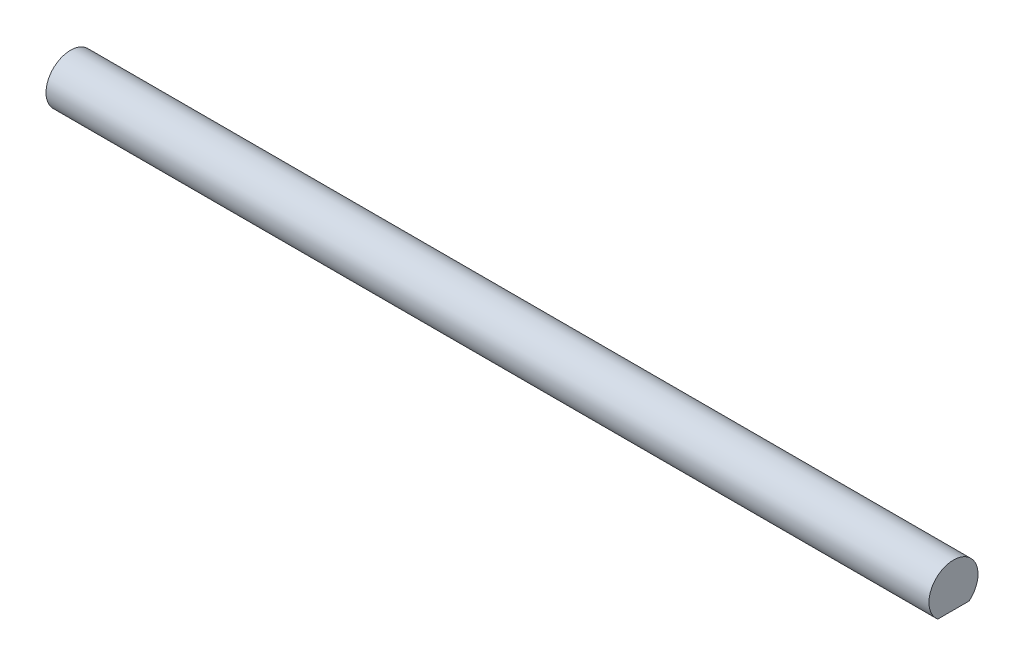
ISO-10303-21;
HEADER;
FILE_DESCRIPTION(('STEP AP214'),'2;1');
FILE_NAME('part.step','',(''),(''),'','','');
FILE_SCHEMA(('AUTOMOTIVE_DESIGN { 1 0 10303 214 1 1 1 1 }'));
ENDSEC;
DATA;
#1=APPLICATION_CONTEXT('core data for automotive mechanical design processes');
#2=APPLICATION_PROTOCOL_DEFINITION('international standard','automotive_design',2000,#1);
#3=PRODUCT_CONTEXT('',#1,'mechanical');
#4=PRODUCT('Part','Part','',(#3));
#5=PRODUCT_RELATED_PRODUCT_CATEGORY('part','',(#4));
#6=PRODUCT_DEFINITION_FORMATION('','',#4);
#7=PRODUCT_DEFINITION_CONTEXT('part definition',#1,'design');
#8=PRODUCT_DEFINITION('design','',#6,#7);
#9=PRODUCT_DEFINITION_SHAPE('','',#8);
#10=(LENGTH_UNIT() NAMED_UNIT(*) SI_UNIT(.MILLI.,.METRE.));
#11=(NAMED_UNIT(*) PLANE_ANGLE_UNIT() SI_UNIT($,.RADIAN.));
#12=(NAMED_UNIT(*) SI_UNIT($,.STERADIAN.) SOLID_ANGLE_UNIT());
#13=UNCERTAINTY_MEASURE_WITH_UNIT(LENGTH_MEASURE(1.E-05),#10,'distance_accuracy_value','');
#14=(GEOMETRIC_REPRESENTATION_CONTEXT(3) GLOBAL_UNCERTAINTY_ASSIGNED_CONTEXT((#13)) GLOBAL_UNIT_ASSIGNED_CONTEXT((#10,
#11,#12)) REPRESENTATION_CONTEXT('',''));
#15=CARTESIAN_POINT('',(0.,0.,0.));
#16=DIRECTION('',(0.,0.,1.));
#17=DIRECTION('',(1.,0.,0.));
#18=AXIS2_PLACEMENT_3D('',#15,#16,#17);
#19=CARTESIAN_POINT('',(304.8,-2.43959033446192,0.));
#20=DIRECTION('',(0.,1.,0.));
#21=DIRECTION('',(0.,0.,1.));
#22=AXIS2_PLACEMENT_3D('',#19,#20,#21);
#23=PLANE('',#22);
#24=DIRECTION('',(0.,0.,-1.));
#25=VECTOR('',#24,1.);
#26=CARTESIAN_POINT('',(114.3,-2.43959033446192,0.));
#27=LINE('',#26,#25);
#28=CARTESIAN_POINT('',(114.3,-2.43959033446192,2.032));
#29=VERTEX_POINT('',#28);
#30=CARTESIAN_POINT('',(114.3,-2.43959033446192,-2.032));
#31=VERTEX_POINT('',#30);
#32=EDGE_CURVE('E51',#29,#31,#27,.T.);
#33=ORIENTED_EDGE('',*,*,#32,.F.);
#34=DIRECTION('',(-1.,0.,0.));
#35=VECTOR('',#34,1.);
#36=CARTESIAN_POINT('',(304.8,-2.43959033446192,2.032));
#37=LINE('',#36,#35);
#38=CARTESIAN_POINT('',(0.,-2.43959033446192,2.032));
#39=VERTEX_POINT('',#38);
#40=EDGE_CURVE('E45',#29,#39,#37,.T.);
#41=ORIENTED_EDGE('',*,*,#40,.T.);
#42=DIRECTION('',(0.,0.,-1.));
#43=VECTOR('',#42,1.);
#44=CARTESIAN_POINT('',(0.,-2.43959033446192,0.));
#45=LINE('',#44,#43);
#46=CARTESIAN_POINT('',(0.,-2.43959033446192,-2.032));
#47=VERTEX_POINT('',#46);
#48=EDGE_CURVE('E67',#39,#47,#45,.T.);
#49=ORIENTED_EDGE('',*,*,#48,.T.);
#50=DIRECTION('',(-1.,0.,0.));
#51=VECTOR('',#50,1.);
#52=CARTESIAN_POINT('',(304.8,-2.43959033446192,-2.032));
#53=LINE('',#52,#51);
#54=EDGE_CURVE('E11',#31,#47,#53,.T.);
#55=ORIENTED_EDGE('',*,*,#54,.F.);
#56=EDGE_LOOP('',(#33,#41,#49,#55));
#57=FACE_BOUND('',#56,.T.);
#58=ADVANCED_FACE('F38',(#57),#23,.F.);
#59=CARTESIAN_POINT('',(304.8,0.,0.));
#60=DIRECTION('',(-1.,0.,0.));
#61=DIRECTION('',(0.,0.,1.));
#62=AXIS2_PLACEMENT_3D('',#59,#60,#61);
#63=CYLINDRICAL_SURFACE('',#62,3.175);
#64=CARTESIAN_POINT('',(114.3,0.,0.));
#65=DIRECTION('',(1.,0.,0.));
#66=DIRECTION('',(0.,0.,-1.));
#67=AXIS2_PLACEMENT_3D('',#64,#65,#66);
#68=CIRCLE('',#67,3.175);
#69=EDGE_CURVE('E62',#31,#29,#68,.T.);
#70=ORIENTED_EDGE('',*,*,#69,.F.);
#71=ORIENTED_EDGE('',*,*,#54,.T.);
#72=CARTESIAN_POINT('',(0.,0.,0.));
#73=DIRECTION('',(1.,0.,0.));
#74=DIRECTION('',(0.,0.,-1.));
#75=AXIS2_PLACEMENT_3D('',#72,#73,#74);
#76=CIRCLE('',#75,3.175);
#77=EDGE_CURVE('E71',#47,#39,#76,.T.);
#78=ORIENTED_EDGE('',*,*,#77,.T.);
#79=ORIENTED_EDGE('',*,*,#40,.F.);
#80=EDGE_LOOP('',(#70,#71,#78,#79));
#81=FACE_BOUND('',#80,.T.);
#82=ADVANCED_FACE('F69',(#81),#63,.T.);
#83=CARTESIAN_POINT('',(0.,0.,0.));
#84=DIRECTION('',(1.,0.,0.));
#85=DIRECTION('',(0.,0.,-1.));
#86=AXIS2_PLACEMENT_3D('',#83,#84,#85);
#87=PLANE('',#86);
#88=ORIENTED_EDGE('',*,*,#48,.F.);
#89=ORIENTED_EDGE('',*,*,#77,.F.);
#90=EDGE_LOOP('',(#88,#89));
#91=FACE_BOUND('',#90,.T.);
#92=ADVANCED_FACE('F76',(#91),#87,.F.);
#93=CARTESIAN_POINT('',(114.3,0.,0.));
#94=DIRECTION('',(1.,0.,0.));
#95=DIRECTION('',(0.,0.,-1.));
#96=AXIS2_PLACEMENT_3D('',#93,#94,#95);
#97=PLANE('',#96);
#98=ORIENTED_EDGE('',*,*,#32,.T.);
#99=ORIENTED_EDGE('',*,*,#69,.T.);
#100=EDGE_LOOP('',(#98,#99));
#101=FACE_BOUND('',#100,.T.);
#102=ADVANCED_FACE('F63',(#101),#97,.T.);
#103=CLOSED_SHELL('',(#58,#82,#92,#102));
#104=MANIFOLD_SOLID_BREP('B2',#103);
#105=ADVANCED_BREP_SHAPE_REPRESENTATION('',(#18,#104),#14);
#106=SHAPE_DEFINITION_REPRESENTATION(#9,#105);
ENDSEC;
END-ISO-10303-21;
